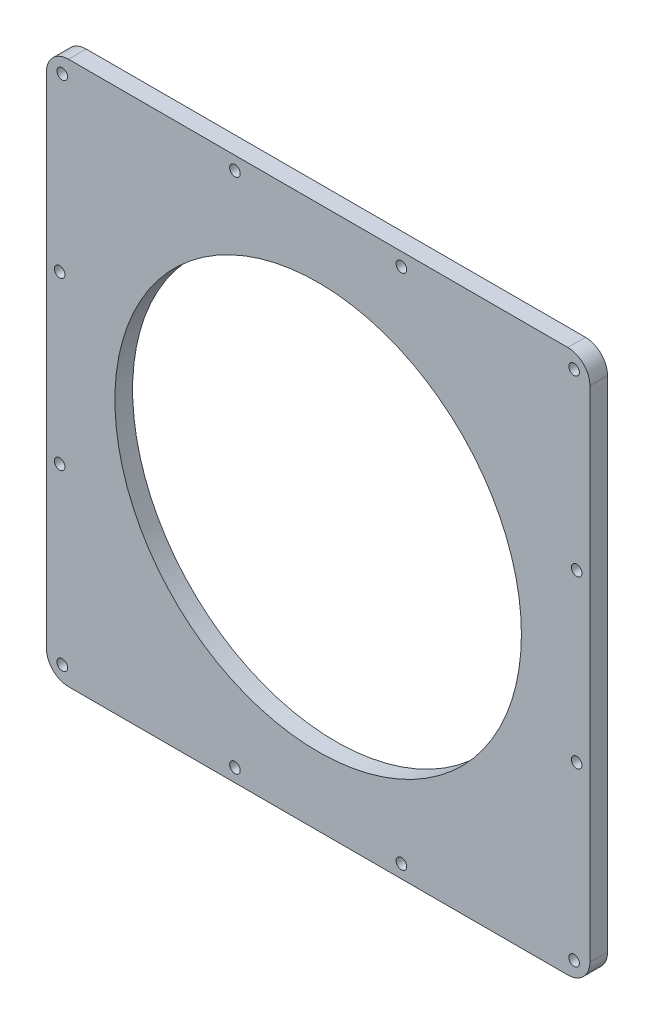
ISO-10303-21;
HEADER;
FILE_DESCRIPTION(('STEP AP214'),'2;1');
FILE_NAME('part.step','',(''),(''),'','','');
FILE_SCHEMA(('AUTOMOTIVE_DESIGN { 1 0 10303 214 1 1 1 1 }'));
ENDSEC;
DATA;
#1=APPLICATION_CONTEXT('core data for automotive mechanical design processes');
#2=APPLICATION_PROTOCOL_DEFINITION('international standard','automotive_design',2000,#1);
#3=PRODUCT_CONTEXT('',#1,'mechanical');
#4=PRODUCT('Part','Part','',(#3));
#5=PRODUCT_RELATED_PRODUCT_CATEGORY('part','',(#4));
#6=PRODUCT_DEFINITION_FORMATION('','',#4);
#7=PRODUCT_DEFINITION_CONTEXT('part definition',#1,'design');
#8=PRODUCT_DEFINITION('design','',#6,#7);
#9=PRODUCT_DEFINITION_SHAPE('','',#8);
#10=(LENGTH_UNIT() NAMED_UNIT(*) SI_UNIT(.MILLI.,.METRE.));
#11=(NAMED_UNIT(*) PLANE_ANGLE_UNIT() SI_UNIT($,.RADIAN.));
#12=(NAMED_UNIT(*) SI_UNIT($,.STERADIAN.) SOLID_ANGLE_UNIT());
#13=UNCERTAINTY_MEASURE_WITH_UNIT(LENGTH_MEASURE(1.E-05),#10,'distance_accuracy_value','');
#14=(GEOMETRIC_REPRESENTATION_CONTEXT(3) GLOBAL_UNCERTAINTY_ASSIGNED_CONTEXT((#13)) GLOBAL_UNIT_ASSIGNED_CONTEXT((#10,
#11,#12)) REPRESENTATION_CONTEXT('',''));
#15=CARTESIAN_POINT('',(0.,0.,0.));
#16=DIRECTION('',(0.,0.,1.));
#17=DIRECTION('',(1.,0.,0.));
#18=AXIS2_PLACEMENT_3D('',#15,#16,#17);
#19=CARTESIAN_POINT('',(0.,-61.5,2.));
#20=DIRECTION('',(0.,1.,0.));
#21=DIRECTION('',(0.,0.,1.));
#22=AXIS2_PLACEMENT_3D('',#19,#20,#21);
#23=PLANE('',#22);
#24=DIRECTION('',(1.,0.,0.));
#25=VECTOR('',#24,1.);
#26=CARTESIAN_POINT('',(0.,-61.5,-2.));
#27=LINE('',#26,#25);
#28=CARTESIAN_POINT('',(-56.5,-61.5,-2.));
#29=VERTEX_POINT('',#28);
#30=CARTESIAN_POINT('',(56.5,-61.5,-2.));
#31=VERTEX_POINT('',#30);
#32=EDGE_CURVE('E138',#29,#31,#27,.T.);
#33=ORIENTED_EDGE('',*,*,#32,.T.);
#34=DIRECTION('',(0.,0.,-1.));
#35=VECTOR('',#34,1.);
#36=CARTESIAN_POINT('',(56.5,-61.5,2.));
#37=LINE('',#36,#35);
#38=CARTESIAN_POINT('',(56.5,-61.5,2.));
#39=VERTEX_POINT('',#38);
#40=EDGE_CURVE('E113',#31,#39,#37,.F.);
#41=ORIENTED_EDGE('',*,*,#40,.T.);
#42=DIRECTION('',(1.,0.,0.));
#43=VECTOR('',#42,1.);
#44=CARTESIAN_POINT('',(0.,-61.5,2.));
#45=LINE('',#44,#43);
#46=CARTESIAN_POINT('',(-56.5,-61.5,2.));
#47=VERTEX_POINT('',#46);
#48=EDGE_CURVE('E193',#47,#39,#45,.T.);
#49=ORIENTED_EDGE('',*,*,#48,.F.);
#50=DIRECTION('',(0.,0.,-1.));
#51=VECTOR('',#50,1.);
#52=CARTESIAN_POINT('',(-56.5,-61.5,-2.));
#53=LINE('',#52,#51);
#54=EDGE_CURVE('E119',#47,#29,#53,.T.);
#55=ORIENTED_EDGE('',*,*,#54,.T.);
#56=EDGE_LOOP('',(#33,#41,#49,#55));
#57=FACE_BOUND('',#56,.T.);
#58=ADVANCED_FACE('F41',(#57),#23,.F.);
#59=CARTESIAN_POINT('',(61.5,0.,2.));
#60=DIRECTION('',(-1.,0.,0.));
#61=DIRECTION('',(0.,0.,1.));
#62=AXIS2_PLACEMENT_3D('',#59,#60,#61);
#63=PLANE('',#62);
#64=DIRECTION('',(0.,1.,0.));
#65=VECTOR('',#64,1.);
#66=CARTESIAN_POINT('',(61.5,0.,2.));
#67=LINE('',#66,#65);
#68=CARTESIAN_POINT('',(61.5,-56.5,2.));
#69=VERTEX_POINT('',#68);
#70=CARTESIAN_POINT('',(61.5,56.5,2.));
#71=VERTEX_POINT('',#70);
#72=EDGE_CURVE('E129',#69,#71,#67,.T.);
#73=ORIENTED_EDGE('',*,*,#72,.F.);
#74=DIRECTION('',(0.,0.,-1.));
#75=VECTOR('',#74,1.);
#76=CARTESIAN_POINT('',(61.5,-56.5,2.));
#77=LINE('',#76,#75);
#78=CARTESIAN_POINT('',(61.5,-56.5,-2.));
#79=VERTEX_POINT('',#78);
#80=EDGE_CURVE('E112',#69,#79,#77,.T.);
#81=ORIENTED_EDGE('',*,*,#80,.T.);
#82=DIRECTION('',(0.,1.,0.));
#83=VECTOR('',#82,1.);
#84=CARTESIAN_POINT('',(61.5,0.,-2.));
#85=LINE('',#84,#83);
#86=CARTESIAN_POINT('',(61.5,56.5,-2.));
#87=VERTEX_POINT('',#86);
#88=EDGE_CURVE('E126',#79,#87,#85,.T.);
#89=ORIENTED_EDGE('',*,*,#88,.T.);
#90=DIRECTION('',(0.,0.,-1.));
#91=VECTOR('',#90,1.);
#92=CARTESIAN_POINT('',(61.5,56.5,2.));
#93=LINE('',#92,#91);
#94=EDGE_CURVE('E132',#87,#71,#93,.F.);
#95=ORIENTED_EDGE('',*,*,#94,.T.);
#96=EDGE_LOOP('',(#73,#81,#89,#95));
#97=FACE_BOUND('',#96,.T.);
#98=ADVANCED_FACE('F125',(#97),#63,.F.);
#99=CARTESIAN_POINT('',(0.,61.5,2.));
#100=DIRECTION('',(0.,1.,0.));
#101=DIRECTION('',(0.,0.,1.));
#102=AXIS2_PLACEMENT_3D('',#99,#100,#101);
#103=PLANE('',#102);
#104=DIRECTION('',(1.,0.,0.));
#105=VECTOR('',#104,1.);
#106=CARTESIAN_POINT('',(0.,61.5,2.));
#107=LINE('',#106,#105);
#108=CARTESIAN_POINT('',(-56.5,61.5,2.));
#109=VERTEX_POINT('',#108);
#110=CARTESIAN_POINT('',(56.5,61.5,2.));
#111=VERTEX_POINT('',#110);
#112=EDGE_CURVE('E187',#109,#111,#107,.T.);
#113=ORIENTED_EDGE('',*,*,#112,.T.);
#114=DIRECTION('',(0.,0.,-1.));
#115=VECTOR('',#114,1.);
#116=CARTESIAN_POINT('',(56.5,61.5,-2.));
#117=LINE('',#116,#115);
#118=CARTESIAN_POINT('',(56.5,61.5,-2.));
#119=VERTEX_POINT('',#118);
#120=EDGE_CURVE('E181',#111,#119,#117,.T.);
#121=ORIENTED_EDGE('',*,*,#120,.T.);
#122=DIRECTION('',(1.,0.,0.));
#123=VECTOR('',#122,1.);
#124=CARTESIAN_POINT('',(0.,61.5,-2.));
#125=LINE('',#124,#123);
#126=CARTESIAN_POINT('',(-56.5,61.5,-2.));
#127=VERTEX_POINT('',#126);
#128=EDGE_CURVE('E137',#127,#119,#125,.T.);
#129=ORIENTED_EDGE('',*,*,#128,.F.);
#130=DIRECTION('',(0.,0.,-1.));
#131=VECTOR('',#130,1.);
#132=CARTESIAN_POINT('',(-56.5,61.5,2.));
#133=LINE('',#132,#131);
#134=EDGE_CURVE('E178',#127,#109,#133,.F.);
#135=ORIENTED_EDGE('',*,*,#134,.T.);
#136=EDGE_LOOP('',(#113,#121,#129,#135));
#137=FACE_BOUND('',#136,.T.);
#138=ADVANCED_FACE('F347',(#137),#103,.T.);
#139=CARTESIAN_POINT('',(0.,0.,2.));
#140=DIRECTION('',(0.,0.,-1.));
#141=DIRECTION('',(-1.,0.,0.));
#142=AXIS2_PLACEMENT_3D('',#139,#140,#141);
#143=CYLINDRICAL_SURFACE('',#142,46.);
#144=CARTESIAN_POINT('',(0.,0.,2.));
#145=DIRECTION('',(0.,0.,1.));
#146=DIRECTION('',(1.,0.,0.));
#147=AXIS2_PLACEMENT_3D('',#144,#145,#146);
#148=CIRCLE('',#147,46.);
#149=CARTESIAN_POINT('',(46.,0.,2.));
#150=VERTEX_POINT('',#149);
#151=EDGE_CURVE('E151',#150,#150,#148,.T.);
#152=ORIENTED_EDGE('',*,*,#151,.T.);
#153=EDGE_LOOP('',(#152));
#154=FACE_BOUND('',#153,.T.);
#155=CARTESIAN_POINT('',(0.,0.,-2.));
#156=DIRECTION('',(0.,0.,1.));
#157=DIRECTION('',(1.,0.,0.));
#158=AXIS2_PLACEMENT_3D('',#155,#156,#157);
#159=CIRCLE('',#158,46.);
#160=CARTESIAN_POINT('',(46.,0.,-2.));
#161=VERTEX_POINT('',#160);
#162=EDGE_CURVE('E144',#161,#161,#159,.T.);
#163=ORIENTED_EDGE('',*,*,#162,.F.);
#164=EDGE_LOOP('',(#163));
#165=FACE_BOUND('',#164,.T.);
#166=ADVANCED_FACE('F367',(#154,#165),#143,.F.);
#167=CARTESIAN_POINT('',(-61.5,0.,2.));
#168=DIRECTION('',(-1.,0.,0.));
#169=DIRECTION('',(0.,0.,1.));
#170=AXIS2_PLACEMENT_3D('',#167,#168,#169);
#171=PLANE('',#170);
#172=DIRECTION('',(0.,1.,0.));
#173=VECTOR('',#172,1.);
#174=CARTESIAN_POINT('',(-61.5,0.,2.));
#175=LINE('',#174,#173);
#176=CARTESIAN_POINT('',(-61.5,-56.5,2.));
#177=VERTEX_POINT('',#176);
#178=CARTESIAN_POINT('',(-61.5,56.5,2.));
#179=VERTEX_POINT('',#178);
#180=EDGE_CURVE('E153',#177,#179,#175,.T.);
#181=ORIENTED_EDGE('',*,*,#180,.T.);
#182=DIRECTION('',(0.,0.,-1.));
#183=VECTOR('',#182,1.);
#184=CARTESIAN_POINT('',(-61.5,56.5,2.));
#185=LINE('',#184,#183);
#186=CARTESIAN_POINT('',(-61.5,56.5,-2.));
#187=VERTEX_POINT('',#186);
#188=EDGE_CURVE('E11',#179,#187,#185,.T.);
#189=ORIENTED_EDGE('',*,*,#188,.T.);
#190=DIRECTION('',(0.,1.,0.));
#191=VECTOR('',#190,1.);
#192=CARTESIAN_POINT('',(-61.5,0.,-2.));
#193=LINE('',#192,#191);
#194=CARTESIAN_POINT('',(-61.5,-56.5,-2.));
#195=VERTEX_POINT('',#194);
#196=EDGE_CURVE('E142',#195,#187,#193,.T.);
#197=ORIENTED_EDGE('',*,*,#196,.F.);
#198=DIRECTION('',(0.,0.,-1.));
#199=VECTOR('',#198,1.);
#200=CARTESIAN_POINT('',(-61.5,-56.5,2.));
#201=LINE('',#200,#199);
#202=EDGE_CURVE('E50',#195,#177,#201,.F.);
#203=ORIENTED_EDGE('',*,*,#202,.T.);
#204=EDGE_LOOP('',(#181,#189,#197,#203));
#205=FACE_BOUND('',#204,.T.);
#206=ADVANCED_FACE('F313',(#205),#171,.T.);
#207=CARTESIAN_POINT('',(0.,0.,2.));
#208=DIRECTION('',(0.,0.,1.));
#209=DIRECTION('',(1.,0.,0.));
#210=AXIS2_PLACEMENT_3D('',#207,#208,#209);
#211=PLANE('',#210);
#212=CARTESIAN_POINT('',(-57.9142135623731,57.9142135623731,2.));
#213=DIRECTION('',(0.,0.,1.));
#214=DIRECTION('',(1.,0.,0.));
#215=AXIS2_PLACEMENT_3D('',#212,#213,#214);
#216=CIRCLE('',#215,1.2);
#217=CARTESIAN_POINT('',(-56.7142135623731,57.9142135623731,2.));
#218=VERTEX_POINT('',#217);
#219=EDGE_CURVE('E303',#218,#218,#216,.T.);
#220=ORIENTED_EDGE('',*,*,#219,.F.);
#221=EDGE_LOOP('',(#220));
#222=FACE_BOUND('',#221,.T.);
#223=CARTESIAN_POINT('',(57.9142135623731,57.9142135623731,2.));
#224=DIRECTION('',(0.,0.,1.));
#225=DIRECTION('',(1.,0.,0.));
#226=AXIS2_PLACEMENT_3D('',#223,#224,#225);
#227=CIRCLE('',#226,1.2);
#228=CARTESIAN_POINT('',(59.1142135623731,57.9142135623731,2.));
#229=VERTEX_POINT('',#228);
#230=EDGE_CURVE('E295',#229,#229,#227,.T.);
#231=ORIENTED_EDGE('',*,*,#230,.F.);
#232=EDGE_LOOP('',(#231));
#233=FACE_BOUND('',#232,.T.);
#234=CARTESIAN_POINT('',(57.9142135623731,-57.9142135623731,2.));
#235=DIRECTION('',(0.,0.,1.));
#236=DIRECTION('',(1.,0.,0.));
#237=AXIS2_PLACEMENT_3D('',#234,#235,#236);
#238=CIRCLE('',#237,1.2);
#239=CARTESIAN_POINT('',(59.1142135623731,-57.9142135623731,2.));
#240=VERTEX_POINT('',#239);
#241=EDGE_CURVE('E287',#240,#240,#238,.T.);
#242=ORIENTED_EDGE('',*,*,#241,.F.);
#243=EDGE_LOOP('',(#242));
#244=FACE_BOUND('',#243,.T.);
#245=CARTESIAN_POINT('',(-57.9142135623731,-57.9142135623731,2.));
#246=DIRECTION('',(0.,0.,1.));
#247=DIRECTION('',(1.,0.,0.));
#248=AXIS2_PLACEMENT_3D('',#245,#246,#247);
#249=CIRCLE('',#248,1.2);
#250=CARTESIAN_POINT('',(-56.7142135623731,-57.9142135623731,2.));
#251=VERTEX_POINT('',#250);
#252=EDGE_CURVE('E279',#251,#251,#249,.T.);
#253=ORIENTED_EDGE('',*,*,#252,.F.);
#254=EDGE_LOOP('',(#253));
#255=FACE_BOUND('',#254,.T.);
#256=CARTESIAN_POINT('',(-18.8333333333333,-58.5,2.));
#257=DIRECTION('',(0.,0.,1.));
#258=DIRECTION('',(1.,0.,0.));
#259=AXIS2_PLACEMENT_3D('',#256,#257,#258);
#260=CIRCLE('',#259,1.2);
#261=CARTESIAN_POINT('',(-17.6333333333333,-58.5,2.));
#262=VERTEX_POINT('',#261);
#263=EDGE_CURVE('E271',#262,#262,#260,.T.);
#264=ORIENTED_EDGE('',*,*,#263,.F.);
#265=EDGE_LOOP('',(#264));
#266=FACE_BOUND('',#265,.T.);
#267=CARTESIAN_POINT('',(18.8333333333333,-58.5,2.));
#268=DIRECTION('',(0.,0.,1.));
#269=DIRECTION('',(1.,0.,0.));
#270=AXIS2_PLACEMENT_3D('',#267,#268,#269);
#271=CIRCLE('',#270,1.2);
#272=CARTESIAN_POINT('',(20.0333333333333,-58.5,2.));
#273=VERTEX_POINT('',#272);
#274=EDGE_CURVE('E263',#273,#273,#271,.T.);
#275=ORIENTED_EDGE('',*,*,#274,.F.);
#276=EDGE_LOOP('',(#275));
#277=FACE_BOUND('',#276,.T.);
#278=CARTESIAN_POINT('',(-58.5,-18.8333333333333,2.));
#279=DIRECTION('',(0.,0.,1.));
#280=DIRECTION('',(1.,0.,0.));
#281=AXIS2_PLACEMENT_3D('',#278,#279,#280);
#282=CIRCLE('',#281,1.2);
#283=CARTESIAN_POINT('',(-57.3,-18.8333333333333,2.));
#284=VERTEX_POINT('',#283);
#285=EDGE_CURVE('E255',#284,#284,#282,.T.);
#286=ORIENTED_EDGE('',*,*,#285,.F.);
#287=EDGE_LOOP('',(#286));
#288=FACE_BOUND('',#287,.T.);
#289=CARTESIAN_POINT('',(-58.5,18.8333333333333,2.));
#290=DIRECTION('',(0.,0.,1.));
#291=DIRECTION('',(1.,0.,0.));
#292=AXIS2_PLACEMENT_3D('',#289,#290,#291);
#293=CIRCLE('',#292,1.2);
#294=CARTESIAN_POINT('',(-57.3,18.8333333333333,2.));
#295=VERTEX_POINT('',#294);
#296=EDGE_CURVE('E247',#295,#295,#293,.T.);
#297=ORIENTED_EDGE('',*,*,#296,.F.);
#298=EDGE_LOOP('',(#297));
#299=FACE_BOUND('',#298,.T.);
#300=CARTESIAN_POINT('',(-18.8333333333333,58.5,2.));
#301=DIRECTION('',(0.,0.,1.));
#302=DIRECTION('',(1.,0.,0.));
#303=AXIS2_PLACEMENT_3D('',#300,#301,#302);
#304=CIRCLE('',#303,1.2);
#305=CARTESIAN_POINT('',(-17.6333333333333,58.5,2.));
#306=VERTEX_POINT('',#305);
#307=EDGE_CURVE('E239',#306,#306,#304,.T.);
#308=ORIENTED_EDGE('',*,*,#307,.F.);
#309=EDGE_LOOP('',(#308));
#310=FACE_BOUND('',#309,.T.);
#311=CARTESIAN_POINT('',(18.8333333333333,58.5,2.));
#312=DIRECTION('',(0.,0.,1.));
#313=DIRECTION('',(1.,0.,0.));
#314=AXIS2_PLACEMENT_3D('',#311,#312,#313);
#315=CIRCLE('',#314,1.2);
#316=CARTESIAN_POINT('',(20.0333333333333,58.5,2.));
#317=VERTEX_POINT('',#316);
#318=EDGE_CURVE('E231',#317,#317,#315,.T.);
#319=ORIENTED_EDGE('',*,*,#318,.F.);
#320=EDGE_LOOP('',(#319));
#321=FACE_BOUND('',#320,.T.);
#322=CARTESIAN_POINT('',(58.5,18.8333333333333,2.));
#323=DIRECTION('',(0.,0.,1.));
#324=DIRECTION('',(1.,0.,0.));
#325=AXIS2_PLACEMENT_3D('',#322,#323,#324);
#326=CIRCLE('',#325,1.2);
#327=CARTESIAN_POINT('',(59.7,18.8333333333333,2.));
#328=VERTEX_POINT('',#327);
#329=EDGE_CURVE('E221',#328,#328,#326,.T.);
#330=ORIENTED_EDGE('',*,*,#329,.F.);
#331=EDGE_LOOP('',(#330));
#332=FACE_BOUND('',#331,.T.);
#333=CARTESIAN_POINT('',(58.5,-18.8333333333333,2.));
#334=DIRECTION('',(0.,0.,1.));
#335=DIRECTION('',(1.,0.,0.));
#336=AXIS2_PLACEMENT_3D('',#333,#334,#335);
#337=CIRCLE('',#336,1.2);
#338=CARTESIAN_POINT('',(59.7,-18.8333333333333,2.));
#339=VERTEX_POINT('',#338);
#340=EDGE_CURVE('E211',#339,#339,#337,.T.);
#341=ORIENTED_EDGE('',*,*,#340,.F.);
#342=EDGE_LOOP('',(#341));
#343=FACE_BOUND('',#342,.T.);
#344=ORIENTED_EDGE('',*,*,#151,.F.);
#345=EDGE_LOOP('',(#344));
#346=FACE_BOUND('',#345,.T.);
#347=ORIENTED_EDGE('',*,*,#48,.T.);
#348=CARTESIAN_POINT('',(56.5,-56.5,2.));
#349=DIRECTION('',(0.,0.,1.));
#350=DIRECTION('',(1.,0.,0.));
#351=AXIS2_PLACEMENT_3D('',#348,#349,#350);
#352=CIRCLE('',#351,5.);
#353=EDGE_CURVE('E175',#39,#69,#352,.T.);
#354=ORIENTED_EDGE('',*,*,#353,.T.);
#355=ORIENTED_EDGE('',*,*,#72,.T.);
#356=CARTESIAN_POINT('',(56.5,56.5,2.));
#357=DIRECTION('',(0.,0.,1.));
#358=DIRECTION('',(1.,0.,0.));
#359=AXIS2_PLACEMENT_3D('',#356,#357,#358);
#360=CIRCLE('',#359,5.);
#361=EDGE_CURVE('E172',#71,#111,#360,.T.);
#362=ORIENTED_EDGE('',*,*,#361,.T.);
#363=ORIENTED_EDGE('',*,*,#112,.F.);
#364=CARTESIAN_POINT('',(-56.5,56.5,2.));
#365=DIRECTION('',(0.,0.,1.));
#366=DIRECTION('',(1.,0.,0.));
#367=AXIS2_PLACEMENT_3D('',#364,#365,#366);
#368=CIRCLE('',#367,5.);
#369=EDGE_CURVE('E57',#109,#179,#368,.T.);
#370=ORIENTED_EDGE('',*,*,#369,.T.);
#371=ORIENTED_EDGE('',*,*,#180,.F.);
#372=CARTESIAN_POINT('',(-56.5,-56.5,2.));
#373=DIRECTION('',(0.,0.,1.));
#374=DIRECTION('',(1.,0.,0.));
#375=AXIS2_PLACEMENT_3D('',#372,#373,#374);
#376=CIRCLE('',#375,5.);
#377=EDGE_CURVE('E167',#177,#47,#376,.T.);
#378=ORIENTED_EDGE('',*,*,#377,.T.);
#379=EDGE_LOOP('',(#347,#354,#355,#362,#363,#370,#371,#378));
#380=FACE_BOUND('',#379,.T.);
#381=ADVANCED_FACE('F310',(#222,#233,#244,#255,#266,#277,#288,#299,#310,#321,#332,#343,#346,
#380),#211,.T.);
#382=CARTESIAN_POINT('',(0.,0.,-2.));
#383=DIRECTION('',(0.,0.,1.));
#384=DIRECTION('',(1.,0.,0.));
#385=AXIS2_PLACEMENT_3D('',#382,#383,#384);
#386=PLANE('',#385);
#387=CARTESIAN_POINT('',(-57.9142135623731,57.9142135623731,-2.));
#388=DIRECTION('',(0.,0.,1.));
#389=DIRECTION('',(1.,0.,0.));
#390=AXIS2_PLACEMENT_3D('',#387,#388,#389);
#391=CIRCLE('',#390,1.2);
#392=CARTESIAN_POINT('',(-56.7142135623731,57.9142135623731,-2.));
#393=VERTEX_POINT('',#392);
#394=EDGE_CURVE('E299',#393,#393,#391,.T.);
#395=ORIENTED_EDGE('',*,*,#394,.T.);
#396=EDGE_LOOP('',(#395));
#397=FACE_BOUND('',#396,.T.);
#398=CARTESIAN_POINT('',(57.9142135623731,57.9142135623731,-2.));
#399=DIRECTION('',(0.,0.,1.));
#400=DIRECTION('',(1.,0.,0.));
#401=AXIS2_PLACEMENT_3D('',#398,#399,#400);
#402=CIRCLE('',#401,1.2);
#403=CARTESIAN_POINT('',(59.1142135623731,57.9142135623731,-2.));
#404=VERTEX_POINT('',#403);
#405=EDGE_CURVE('E291',#404,#404,#402,.T.);
#406=ORIENTED_EDGE('',*,*,#405,.T.);
#407=EDGE_LOOP('',(#406));
#408=FACE_BOUND('',#407,.T.);
#409=CARTESIAN_POINT('',(57.9142135623731,-57.9142135623731,-2.));
#410=DIRECTION('',(0.,0.,1.));
#411=DIRECTION('',(1.,0.,0.));
#412=AXIS2_PLACEMENT_3D('',#409,#410,#411);
#413=CIRCLE('',#412,1.2);
#414=CARTESIAN_POINT('',(59.1142135623731,-57.9142135623731,-2.));
#415=VERTEX_POINT('',#414);
#416=EDGE_CURVE('E283',#415,#415,#413,.T.);
#417=ORIENTED_EDGE('',*,*,#416,.T.);
#418=EDGE_LOOP('',(#417));
#419=FACE_BOUND('',#418,.T.);
#420=CARTESIAN_POINT('',(-57.9142135623731,-57.9142135623731,-2.));
#421=DIRECTION('',(0.,0.,1.));
#422=DIRECTION('',(1.,0.,0.));
#423=AXIS2_PLACEMENT_3D('',#420,#421,#422);
#424=CIRCLE('',#423,1.2);
#425=CARTESIAN_POINT('',(-56.7142135623731,-57.9142135623731,-2.));
#426=VERTEX_POINT('',#425);
#427=EDGE_CURVE('E275',#426,#426,#424,.T.);
#428=ORIENTED_EDGE('',*,*,#427,.T.);
#429=EDGE_LOOP('',(#428));
#430=FACE_BOUND('',#429,.T.);
#431=CARTESIAN_POINT('',(-18.8333333333333,-58.5,-2.));
#432=DIRECTION('',(0.,0.,1.));
#433=DIRECTION('',(1.,0.,0.));
#434=AXIS2_PLACEMENT_3D('',#431,#432,#433);
#435=CIRCLE('',#434,1.2);
#436=CARTESIAN_POINT('',(-17.6333333333333,-58.5,-2.));
#437=VERTEX_POINT('',#436);
#438=EDGE_CURVE('E267',#437,#437,#435,.T.);
#439=ORIENTED_EDGE('',*,*,#438,.T.);
#440=EDGE_LOOP('',(#439));
#441=FACE_BOUND('',#440,.T.);
#442=CARTESIAN_POINT('',(18.8333333333333,-58.5,-2.));
#443=DIRECTION('',(0.,0.,1.));
#444=DIRECTION('',(1.,0.,0.));
#445=AXIS2_PLACEMENT_3D('',#442,#443,#444);
#446=CIRCLE('',#445,1.2);
#447=CARTESIAN_POINT('',(20.0333333333333,-58.5,-2.));
#448=VERTEX_POINT('',#447);
#449=EDGE_CURVE('E259',#448,#448,#446,.T.);
#450=ORIENTED_EDGE('',*,*,#449,.T.);
#451=EDGE_LOOP('',(#450));
#452=FACE_BOUND('',#451,.T.);
#453=CARTESIAN_POINT('',(-58.5,-18.8333333333333,-2.));
#454=DIRECTION('',(0.,0.,1.));
#455=DIRECTION('',(1.,0.,0.));
#456=AXIS2_PLACEMENT_3D('',#453,#454,#455);
#457=CIRCLE('',#456,1.2);
#458=CARTESIAN_POINT('',(-57.3,-18.8333333333333,-2.));
#459=VERTEX_POINT('',#458);
#460=EDGE_CURVE('E251',#459,#459,#457,.T.);
#461=ORIENTED_EDGE('',*,*,#460,.T.);
#462=EDGE_LOOP('',(#461));
#463=FACE_BOUND('',#462,.T.);
#464=CARTESIAN_POINT('',(-58.5,18.8333333333333,-2.));
#465=DIRECTION('',(0.,0.,1.));
#466=DIRECTION('',(1.,0.,0.));
#467=AXIS2_PLACEMENT_3D('',#464,#465,#466);
#468=CIRCLE('',#467,1.2);
#469=CARTESIAN_POINT('',(-57.3,18.8333333333333,-2.));
#470=VERTEX_POINT('',#469);
#471=EDGE_CURVE('E243',#470,#470,#468,.T.);
#472=ORIENTED_EDGE('',*,*,#471,.T.);
#473=EDGE_LOOP('',(#472));
#474=FACE_BOUND('',#473,.T.);
#475=CARTESIAN_POINT('',(-18.8333333333333,58.5,-2.));
#476=DIRECTION('',(0.,0.,1.));
#477=DIRECTION('',(1.,0.,0.));
#478=AXIS2_PLACEMENT_3D('',#475,#476,#477);
#479=CIRCLE('',#478,1.2);
#480=CARTESIAN_POINT('',(-17.6333333333333,58.5,-2.));
#481=VERTEX_POINT('',#480);
#482=EDGE_CURVE('E235',#481,#481,#479,.T.);
#483=ORIENTED_EDGE('',*,*,#482,.T.);
#484=EDGE_LOOP('',(#483));
#485=FACE_BOUND('',#484,.T.);
#486=CARTESIAN_POINT('',(18.8333333333333,58.5,-2.));
#487=DIRECTION('',(0.,0.,1.));
#488=DIRECTION('',(1.,0.,0.));
#489=AXIS2_PLACEMENT_3D('',#486,#487,#488);
#490=CIRCLE('',#489,1.2);
#491=CARTESIAN_POINT('',(20.0333333333333,58.5,-2.));
#492=VERTEX_POINT('',#491);
#493=EDGE_CURVE('E227',#492,#492,#490,.T.);
#494=ORIENTED_EDGE('',*,*,#493,.T.);
#495=EDGE_LOOP('',(#494));
#496=FACE_BOUND('',#495,.T.);
#497=CARTESIAN_POINT('',(58.5,18.8333333333333,-2.));
#498=DIRECTION('',(0.,0.,1.));
#499=DIRECTION('',(1.,0.,0.));
#500=AXIS2_PLACEMENT_3D('',#497,#498,#499);
#501=CIRCLE('',#500,1.2);
#502=CARTESIAN_POINT('',(59.7,18.8333333333333,-2.));
#503=VERTEX_POINT('',#502);
#504=EDGE_CURVE('E216',#503,#503,#501,.T.);
#505=ORIENTED_EDGE('',*,*,#504,.T.);
#506=EDGE_LOOP('',(#505));
#507=FACE_BOUND('',#506,.T.);
#508=CARTESIAN_POINT('',(58.5,-18.8333333333333,-2.));
#509=DIRECTION('',(0.,0.,1.));
#510=DIRECTION('',(1.,0.,0.));
#511=AXIS2_PLACEMENT_3D('',#508,#509,#510);
#512=CIRCLE('',#511,1.2);
#513=CARTESIAN_POINT('',(59.7,-18.8333333333333,-2.));
#514=VERTEX_POINT('',#513);
#515=EDGE_CURVE('E203',#514,#514,#512,.T.);
#516=ORIENTED_EDGE('',*,*,#515,.T.);
#517=EDGE_LOOP('',(#516));
#518=FACE_BOUND('',#517,.T.);
#519=ORIENTED_EDGE('',*,*,#162,.T.);
#520=EDGE_LOOP('',(#519));
#521=FACE_BOUND('',#520,.T.);
#522=ORIENTED_EDGE('',*,*,#88,.F.);
#523=CARTESIAN_POINT('',(56.5,-56.5,-2.));
#524=DIRECTION('',(0.,0.,1.));
#525=DIRECTION('',(1.,0.,0.));
#526=AXIS2_PLACEMENT_3D('',#523,#524,#525);
#527=CIRCLE('',#526,5.);
#528=EDGE_CURVE('E108',#79,#31,#527,.F.);
#529=ORIENTED_EDGE('',*,*,#528,.T.);
#530=ORIENTED_EDGE('',*,*,#32,.F.);
#531=CARTESIAN_POINT('',(-56.5,-56.5,-2.));
#532=DIRECTION('',(0.,0.,1.));
#533=DIRECTION('',(1.,0.,0.));
#534=AXIS2_PLACEMENT_3D('',#531,#532,#533);
#535=CIRCLE('',#534,5.);
#536=EDGE_CURVE('E131',#29,#195,#535,.F.);
#537=ORIENTED_EDGE('',*,*,#536,.T.);
#538=ORIENTED_EDGE('',*,*,#196,.T.);
#539=CARTESIAN_POINT('',(-56.5,56.5,-2.));
#540=DIRECTION('',(0.,0.,1.));
#541=DIRECTION('',(1.,0.,0.));
#542=AXIS2_PLACEMENT_3D('',#539,#540,#541);
#543=CIRCLE('',#542,5.);
#544=EDGE_CURVE('E157',#187,#127,#543,.F.);
#545=ORIENTED_EDGE('',*,*,#544,.T.);
#546=ORIENTED_EDGE('',*,*,#128,.T.);
#547=CARTESIAN_POINT('',(56.5,56.5,-2.));
#548=DIRECTION('',(0.,0.,1.));
#549=DIRECTION('',(1.,0.,0.));
#550=AXIS2_PLACEMENT_3D('',#547,#548,#549);
#551=CIRCLE('',#550,5.);
#552=EDGE_CURVE('E120',#119,#87,#551,.F.);
#553=ORIENTED_EDGE('',*,*,#552,.T.);
#554=EDGE_LOOP('',(#522,#529,#530,#537,#538,#545,#546,#553));
#555=FACE_BOUND('',#554,.T.);
#556=ADVANCED_FACE('F134',(#397,#408,#419,#430,#441,#452,#463,#474,#485,#496,#507,#518,#521,
#555),#386,.F.);
#557=CARTESIAN_POINT('',(56.5,-56.5,2.));
#558=DIRECTION('',(0.,0.,-1.));
#559=DIRECTION('',(-1.,0.,0.));
#560=AXIS2_PLACEMENT_3D('',#557,#558,#559);
#561=CYLINDRICAL_SURFACE('',#560,5.);
#562=ORIENTED_EDGE('',*,*,#353,.F.);
#563=ORIENTED_EDGE('',*,*,#40,.F.);
#564=ORIENTED_EDGE('',*,*,#528,.F.);
#565=ORIENTED_EDGE('',*,*,#80,.F.);
#566=EDGE_LOOP('',(#562,#563,#564,#565));
#567=FACE_BOUND('',#566,.T.);
#568=ADVANCED_FACE('F111',(#567),#561,.T.);
#569=CARTESIAN_POINT('',(56.5,56.5,2.));
#570=DIRECTION('',(0.,0.,1.));
#571=DIRECTION('',(1.,0.,0.));
#572=AXIS2_PLACEMENT_3D('',#569,#570,#571);
#573=CYLINDRICAL_SURFACE('',#572,5.);
#574=ORIENTED_EDGE('',*,*,#361,.F.);
#575=ORIENTED_EDGE('',*,*,#94,.F.);
#576=ORIENTED_EDGE('',*,*,#552,.F.);
#577=ORIENTED_EDGE('',*,*,#120,.F.);
#578=EDGE_LOOP('',(#574,#575,#576,#577));
#579=FACE_BOUND('',#578,.T.);
#580=ADVANCED_FACE('F351',(#579),#573,.T.);
#581=CARTESIAN_POINT('',(-56.5,56.5,2.));
#582=DIRECTION('',(0.,0.,-1.));
#583=DIRECTION('',(-1.,0.,0.));
#584=AXIS2_PLACEMENT_3D('',#581,#582,#583);
#585=CYLINDRICAL_SURFACE('',#584,5.);
#586=ORIENTED_EDGE('',*,*,#369,.F.);
#587=ORIENTED_EDGE('',*,*,#134,.F.);
#588=ORIENTED_EDGE('',*,*,#544,.F.);
#589=ORIENTED_EDGE('',*,*,#188,.F.);
#590=EDGE_LOOP('',(#586,#587,#588,#589));
#591=FACE_BOUND('',#590,.T.);
#592=ADVANCED_FACE('F343',(#591),#585,.T.);
#593=CARTESIAN_POINT('',(-56.5,-56.5,2.));
#594=DIRECTION('',(0.,0.,1.));
#595=DIRECTION('',(1.,0.,0.));
#596=AXIS2_PLACEMENT_3D('',#593,#594,#595);
#597=CYLINDRICAL_SURFACE('',#596,5.);
#598=ORIENTED_EDGE('',*,*,#377,.F.);
#599=ORIENTED_EDGE('',*,*,#202,.F.);
#600=ORIENTED_EDGE('',*,*,#536,.F.);
#601=ORIENTED_EDGE('',*,*,#54,.F.);
#602=EDGE_LOOP('',(#598,#599,#600,#601));
#603=FACE_BOUND('',#602,.T.);
#604=ADVANCED_FACE('F43',(#603),#597,.T.);
#605=CARTESIAN_POINT('',(58.5,-18.8333333333333,2.));
#606=DIRECTION('',(0.,0.,1.));
#607=DIRECTION('',(1.,0.,0.));
#608=AXIS2_PLACEMENT_3D('',#605,#606,#607);
#609=CYLINDRICAL_SURFACE('',#608,1.2);
#610=ORIENTED_EDGE('',*,*,#515,.F.);
#611=EDGE_LOOP('',(#610));
#612=FACE_BOUND('',#611,.T.);
#613=ORIENTED_EDGE('',*,*,#340,.T.);
#614=EDGE_LOOP('',(#613));
#615=FACE_BOUND('',#614,.T.);
#616=ADVANCED_FACE('F381',(#612,#615),#609,.F.);
#617=CARTESIAN_POINT('',(58.5,18.8333333333333,2.));
#618=DIRECTION('',(0.,0.,1.));
#619=DIRECTION('',(1.,0.,0.));
#620=AXIS2_PLACEMENT_3D('',#617,#618,#619);
#621=CYLINDRICAL_SURFACE('',#620,1.2);
#622=ORIENTED_EDGE('',*,*,#504,.F.);
#623=EDGE_LOOP('',(#622));
#624=FACE_BOUND('',#623,.T.);
#625=ORIENTED_EDGE('',*,*,#329,.T.);
#626=EDGE_LOOP('',(#625));
#627=FACE_BOUND('',#626,.T.);
#628=ADVANCED_FACE('F384',(#624,#627),#621,.F.);
#629=CARTESIAN_POINT('',(18.8333333333333,58.5,2.));
#630=DIRECTION('',(0.,0.,1.));
#631=DIRECTION('',(1.,0.,0.));
#632=AXIS2_PLACEMENT_3D('',#629,#630,#631);
#633=CYLINDRICAL_SURFACE('',#632,1.2);
#634=ORIENTED_EDGE('',*,*,#493,.F.);
#635=EDGE_LOOP('',(#634));
#636=FACE_BOUND('',#635,.T.);
#637=ORIENTED_EDGE('',*,*,#318,.T.);
#638=EDGE_LOOP('',(#637));
#639=FACE_BOUND('',#638,.T.);
#640=ADVANCED_FACE('F388',(#636,#639),#633,.F.);
#641=CARTESIAN_POINT('',(-18.8333333333333,58.5,2.));
#642=DIRECTION('',(0.,0.,1.));
#643=DIRECTION('',(1.,0.,0.));
#644=AXIS2_PLACEMENT_3D('',#641,#642,#643);
#645=CYLINDRICAL_SURFACE('',#644,1.2);
#646=ORIENTED_EDGE('',*,*,#482,.F.);
#647=EDGE_LOOP('',(#646));
#648=FACE_BOUND('',#647,.T.);
#649=ORIENTED_EDGE('',*,*,#307,.T.);
#650=EDGE_LOOP('',(#649));
#651=FACE_BOUND('',#650,.T.);
#652=ADVANCED_FACE('F392',(#648,#651),#645,.F.);
#653=CARTESIAN_POINT('',(-58.5,18.8333333333333,2.));
#654=DIRECTION('',(0.,0.,1.));
#655=DIRECTION('',(1.,0.,0.));
#656=AXIS2_PLACEMENT_3D('',#653,#654,#655);
#657=CYLINDRICAL_SURFACE('',#656,1.2);
#658=ORIENTED_EDGE('',*,*,#471,.F.);
#659=EDGE_LOOP('',(#658));
#660=FACE_BOUND('',#659,.T.);
#661=ORIENTED_EDGE('',*,*,#296,.T.);
#662=EDGE_LOOP('',(#661));
#663=FACE_BOUND('',#662,.T.);
#664=ADVANCED_FACE('F396',(#660,#663),#657,.F.);
#665=CARTESIAN_POINT('',(-58.5,-18.8333333333333,2.));
#666=DIRECTION('',(0.,0.,1.));
#667=DIRECTION('',(1.,0.,0.));
#668=AXIS2_PLACEMENT_3D('',#665,#666,#667);
#669=CYLINDRICAL_SURFACE('',#668,1.2);
#670=ORIENTED_EDGE('',*,*,#460,.F.);
#671=EDGE_LOOP('',(#670));
#672=FACE_BOUND('',#671,.T.);
#673=ORIENTED_EDGE('',*,*,#285,.T.);
#674=EDGE_LOOP('',(#673));
#675=FACE_BOUND('',#674,.T.);
#676=ADVANCED_FACE('F400',(#672,#675),#669,.F.);
#677=CARTESIAN_POINT('',(18.8333333333333,-58.5,2.));
#678=DIRECTION('',(0.,0.,1.));
#679=DIRECTION('',(1.,0.,0.));
#680=AXIS2_PLACEMENT_3D('',#677,#678,#679);
#681=CYLINDRICAL_SURFACE('',#680,1.2);
#682=ORIENTED_EDGE('',*,*,#449,.F.);
#683=EDGE_LOOP('',(#682));
#684=FACE_BOUND('',#683,.T.);
#685=ORIENTED_EDGE('',*,*,#274,.T.);
#686=EDGE_LOOP('',(#685));
#687=FACE_BOUND('',#686,.T.);
#688=ADVANCED_FACE('F404',(#684,#687),#681,.F.);
#689=CARTESIAN_POINT('',(-18.8333333333333,-58.5,2.));
#690=DIRECTION('',(0.,0.,1.));
#691=DIRECTION('',(1.,0.,0.));
#692=AXIS2_PLACEMENT_3D('',#689,#690,#691);
#693=CYLINDRICAL_SURFACE('',#692,1.2);
#694=ORIENTED_EDGE('',*,*,#438,.F.);
#695=EDGE_LOOP('',(#694));
#696=FACE_BOUND('',#695,.T.);
#697=ORIENTED_EDGE('',*,*,#263,.T.);
#698=EDGE_LOOP('',(#697));
#699=FACE_BOUND('',#698,.T.);
#700=ADVANCED_FACE('F408',(#696,#699),#693,.F.);
#701=CARTESIAN_POINT('',(-57.9142135623731,-57.9142135623731,2.));
#702=DIRECTION('',(0.,0.,1.));
#703=DIRECTION('',(1.,0.,0.));
#704=AXIS2_PLACEMENT_3D('',#701,#702,#703);
#705=CYLINDRICAL_SURFACE('',#704,1.2);
#706=ORIENTED_EDGE('',*,*,#427,.F.);
#707=EDGE_LOOP('',(#706));
#708=FACE_BOUND('',#707,.T.);
#709=ORIENTED_EDGE('',*,*,#252,.T.);
#710=EDGE_LOOP('',(#709));
#711=FACE_BOUND('',#710,.T.);
#712=ADVANCED_FACE('F412',(#708,#711),#705,.F.);
#713=CARTESIAN_POINT('',(57.9142135623731,-57.9142135623731,2.));
#714=DIRECTION('',(0.,0.,1.));
#715=DIRECTION('',(1.,0.,0.));
#716=AXIS2_PLACEMENT_3D('',#713,#714,#715);
#717=CYLINDRICAL_SURFACE('',#716,1.2);
#718=ORIENTED_EDGE('',*,*,#416,.F.);
#719=EDGE_LOOP('',(#718));
#720=FACE_BOUND('',#719,.T.);
#721=ORIENTED_EDGE('',*,*,#241,.T.);
#722=EDGE_LOOP('',(#721));
#723=FACE_BOUND('',#722,.T.);
#724=ADVANCED_FACE('F416',(#720,#723),#717,.F.);
#725=CARTESIAN_POINT('',(57.9142135623731,57.9142135623731,2.));
#726=DIRECTION('',(0.,0.,1.));
#727=DIRECTION('',(1.,0.,0.));
#728=AXIS2_PLACEMENT_3D('',#725,#726,#727);
#729=CYLINDRICAL_SURFACE('',#728,1.2);
#730=ORIENTED_EDGE('',*,*,#405,.F.);
#731=EDGE_LOOP('',(#730));
#732=FACE_BOUND('',#731,.T.);
#733=ORIENTED_EDGE('',*,*,#230,.T.);
#734=EDGE_LOOP('',(#733));
#735=FACE_BOUND('',#734,.T.);
#736=ADVANCED_FACE('F420',(#732,#735),#729,.F.);
#737=CARTESIAN_POINT('',(-57.9142135623731,57.9142135623731,2.));
#738=DIRECTION('',(0.,0.,1.));
#739=DIRECTION('',(1.,0.,0.));
#740=AXIS2_PLACEMENT_3D('',#737,#738,#739);
#741=CYLINDRICAL_SURFACE('',#740,1.2);
#742=ORIENTED_EDGE('',*,*,#394,.F.);
#743=EDGE_LOOP('',(#742));
#744=FACE_BOUND('',#743,.T.);
#745=ORIENTED_EDGE('',*,*,#219,.T.);
#746=EDGE_LOOP('',(#745));
#747=FACE_BOUND('',#746,.T.);
#748=ADVANCED_FACE('F308',(#744,#747),#741,.F.);
#749=CLOSED_SHELL('',(#58,#98,#138,#166,#206,#381,#556,#568,#580,#592,#604,#616,#628,#640,#652,
#664,#676,#688,#700,#712,#724,#736,#748));
#750=MANIFOLD_SOLID_BREP('B2',#749);
#751=ADVANCED_BREP_SHAPE_REPRESENTATION('',(#18,#750),#14);
#752=SHAPE_DEFINITION_REPRESENTATION(#9,#751);
ENDSEC;
END-ISO-10303-21;
